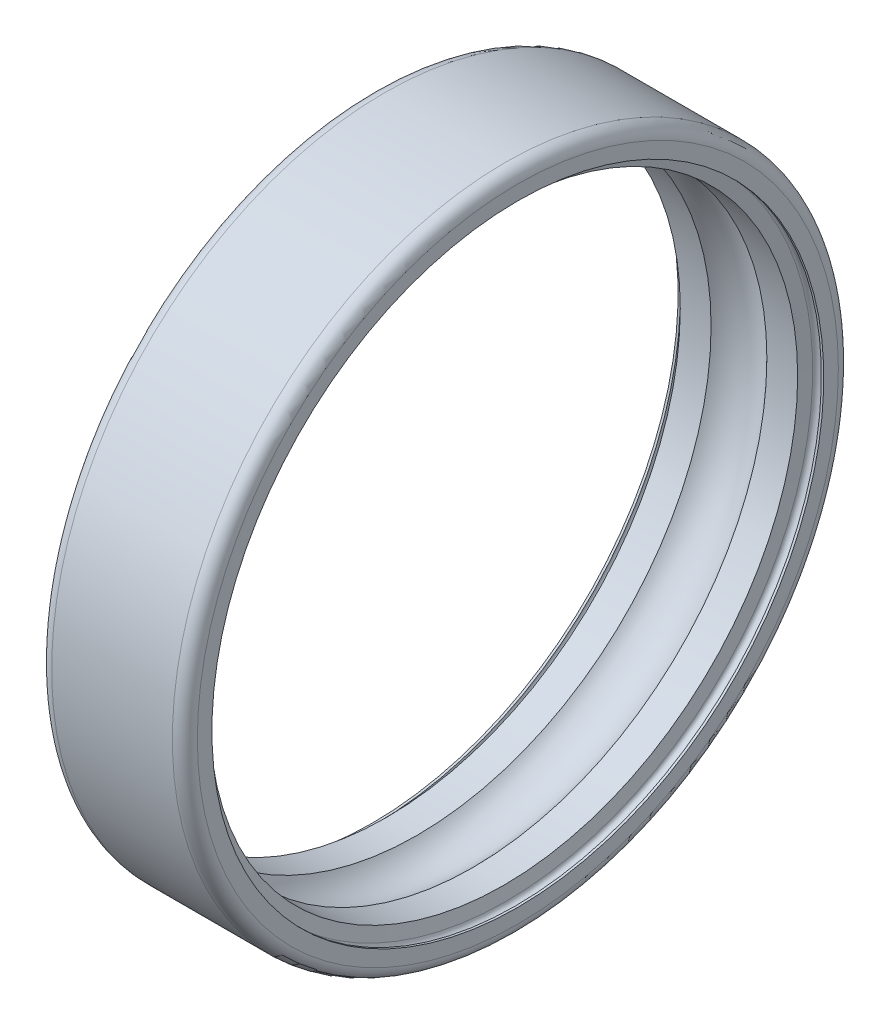
ISO-10303-21;
HEADER;
FILE_DESCRIPTION(('STEP AP214'),'2;1');
FILE_NAME('part.step','',(''),(''),'','','');
FILE_SCHEMA(('AUTOMOTIVE_DESIGN { 1 0 10303 214 1 1 1 1 }'));
ENDSEC;
DATA;
#1=APPLICATION_CONTEXT('core data for automotive mechanical design processes');
#2=APPLICATION_PROTOCOL_DEFINITION('international standard','automotive_design',2000,#1);
#3=PRODUCT_CONTEXT('',#1,'mechanical');
#4=PRODUCT('Part','Part','',(#3));
#5=PRODUCT_RELATED_PRODUCT_CATEGORY('part','',(#4));
#6=PRODUCT_DEFINITION_FORMATION('','',#4);
#7=PRODUCT_DEFINITION_CONTEXT('part definition',#1,'design');
#8=PRODUCT_DEFINITION('design','',#6,#7);
#9=PRODUCT_DEFINITION_SHAPE('','',#8);
#10=(LENGTH_UNIT() NAMED_UNIT(*) SI_UNIT(.MILLI.,.METRE.));
#11=(NAMED_UNIT(*) PLANE_ANGLE_UNIT() SI_UNIT($,.RADIAN.));
#12=(NAMED_UNIT(*) SI_UNIT($,.STERADIAN.) SOLID_ANGLE_UNIT());
#13=UNCERTAINTY_MEASURE_WITH_UNIT(LENGTH_MEASURE(1.E-05),#10,'distance_accuracy_value','');
#14=(GEOMETRIC_REPRESENTATION_CONTEXT(3) GLOBAL_UNCERTAINTY_ASSIGNED_CONTEXT((#13)) GLOBAL_UNIT_ASSIGNED_CONTEXT((#10,
#11,#12)) REPRESENTATION_CONTEXT('',''));
#15=CARTESIAN_POINT('',(0.,0.,0.));
#16=DIRECTION('',(0.,0.,1.));
#17=DIRECTION('',(1.,0.,0.));
#18=AXIS2_PLACEMENT_3D('',#15,#16,#17);
#19=CARTESIAN_POINT('',(6.655,0.,0.));
#20=DIRECTION('',(1.,0.,0.));
#21=DIRECTION('',(0.,0.,-1.));
#22=AXIS2_PLACEMENT_3D('',#19,#20,#21);
#23=TOROIDAL_SURFACE('',#22,14.7,0.23);
#24=CARTESIAN_POINT('',(6.885,0.,0.));
#25=DIRECTION('',(1.,0.,0.));
#26=DIRECTION('',(0.,1.,0.));
#27=AXIS2_PLACEMENT_3D('',#24,#25,#26);
#28=CIRCLE('',#27,14.7);
#29=CARTESIAN_POINT('',(6.885,14.7,0.));
#30=VERTEX_POINT('',#29);
#31=EDGE_CURVE('E10',#30,#30,#28,.T.);
#32=ORIENTED_EDGE('',*,*,#31,.T.);
#33=EDGE_LOOP('',(#32));
#34=FACE_BOUND('',#33,.T.);
#35=CARTESIAN_POINT('',(6.42849421680719,0.,0.));
#36=DIRECTION('',(1.,0.,0.));
#37=DIRECTION('',(0.,1.,0.));
#38=AXIS2_PLACEMENT_3D('',#35,#36,#37);
#39=CIRCLE('',#38,14.7399390808634);
#40=CARTESIAN_POINT('',(6.42849421680719,14.7399390808634,0.));
#41=VERTEX_POINT('',#40);
#42=EDGE_CURVE('E82',#41,#41,#39,.T.);
#43=ORIENTED_EDGE('',*,*,#42,.F.);
#44=EDGE_LOOP('',(#43));
#45=FACE_BOUND('',#44,.T.);
#46=ADVANCED_FACE('F15',(#34,#45),#23,.F.);
#47=CARTESIAN_POINT('',(6.9425,0.,0.));
#48=DIRECTION('',(-1.,0.,0.));
#49=DIRECTION('',(0.,1.,0.));
#50=AXIS2_PLACEMENT_3D('',#47,#48,#49);
#51=CYLINDRICAL_SURFACE('',#50,14.7);
#52=CARTESIAN_POINT('',(7.,0.,0.));
#53=DIRECTION('',(1.,0.,0.));
#54=DIRECTION('',(0.,1.,0.));
#55=AXIS2_PLACEMENT_3D('',#52,#53,#54);
#56=CIRCLE('',#55,14.7);
#57=CARTESIAN_POINT('',(7.,14.7,0.));
#58=VERTEX_POINT('',#57);
#59=EDGE_CURVE('E25',#58,#58,#56,.T.);
#60=ORIENTED_EDGE('',*,*,#59,.T.);
#61=EDGE_LOOP('',(#60));
#62=FACE_BOUND('',#61,.T.);
#63=ORIENTED_EDGE('',*,*,#31,.F.);
#64=EDGE_LOOP('',(#63));
#65=FACE_BOUND('',#64,.T.);
#66=ADVANCED_FACE('F117',(#62,#65),#51,.F.);
#67=CARTESIAN_POINT('',(7.,15.05,0.));
#68=DIRECTION('',(1.,0.,0.));
#69=DIRECTION('',(0.,1.,0.));
#70=AXIS2_PLACEMENT_3D('',#67,#68,#69);
#71=PLANE('',#70);
#72=CARTESIAN_POINT('',(7.,0.,0.));
#73=DIRECTION('',(1.,0.,0.));
#74=DIRECTION('',(0.,1.,0.));
#75=AXIS2_PLACEMENT_3D('',#72,#73,#74);
#76=CIRCLE('',#75,15.4);
#77=CARTESIAN_POINT('',(7.,15.4,0.));
#78=VERTEX_POINT('',#77);
#79=EDGE_CURVE('E90',#78,#78,#76,.T.);
#80=ORIENTED_EDGE('',*,*,#79,.T.);
#81=EDGE_LOOP('',(#80));
#82=FACE_BOUND('',#81,.T.);
#83=ORIENTED_EDGE('',*,*,#59,.F.);
#84=EDGE_LOOP('',(#83));
#85=FACE_BOUND('',#84,.T.);
#86=ADVANCED_FACE('F113',(#82,#85),#71,.T.);
#87=CARTESIAN_POINT('',(6.4,0.,0.));
#88=DIRECTION('',(1.,0.,0.));
#89=DIRECTION('',(0.,0.,-1.));
#90=AXIS2_PLACEMENT_3D('',#87,#88,#89);
#91=TOROIDAL_SURFACE('',#90,15.4,0.6);
#92=CARTESIAN_POINT('',(6.4,0.,0.));
#93=DIRECTION('',(1.,0.,0.));
#94=DIRECTION('',(0.,1.,0.));
#95=AXIS2_PLACEMENT_3D('',#92,#93,#94);
#96=CIRCLE('',#95,16.);
#97=CARTESIAN_POINT('',(6.4,16.,0.));
#98=VERTEX_POINT('',#97);
#99=EDGE_CURVE('E92',#98,#98,#96,.T.);
#100=ORIENTED_EDGE('',*,*,#99,.T.);
#101=EDGE_LOOP('',(#100));
#102=FACE_BOUND('',#101,.T.);
#103=ORIENTED_EDGE('',*,*,#79,.F.);
#104=EDGE_LOOP('',(#103));
#105=FACE_BOUND('',#104,.T.);
#106=ADVANCED_FACE('F17',(#102,#105),#91,.T.);
#107=CARTESIAN_POINT('',(3.5,0.,0.));
#108=DIRECTION('',(-1.,0.,0.));
#109=DIRECTION('',(0.,1.,0.));
#110=AXIS2_PLACEMENT_3D('',#107,#108,#109);
#111=CYLINDRICAL_SURFACE('',#110,16.);
#112=CARTESIAN_POINT('',(0.6,0.,0.));
#113=DIRECTION('',(1.,0.,0.));
#114=DIRECTION('',(0.,1.,0.));
#115=AXIS2_PLACEMENT_3D('',#112,#113,#114);
#116=CIRCLE('',#115,16.);
#117=CARTESIAN_POINT('',(0.6,16.,0.));
#118=VERTEX_POINT('',#117);
#119=EDGE_CURVE('E94',#118,#118,#116,.T.);
#120=ORIENTED_EDGE('',*,*,#119,.T.);
#121=EDGE_LOOP('',(#120));
#122=FACE_BOUND('',#121,.T.);
#123=ORIENTED_EDGE('',*,*,#99,.F.);
#124=EDGE_LOOP('',(#123));
#125=FACE_BOUND('',#124,.T.);
#126=ADVANCED_FACE('F101',(#122,#125),#111,.T.);
#127=CARTESIAN_POINT('',(0.6,0.,0.));
#128=DIRECTION('',(1.,0.,0.));
#129=DIRECTION('',(0.,0.,-1.));
#130=AXIS2_PLACEMENT_3D('',#127,#128,#129);
#131=TOROIDAL_SURFACE('',#130,15.4,0.6);
#132=CARTESIAN_POINT('',(0.,0.,0.));
#133=DIRECTION('',(1.,0.,0.));
#134=DIRECTION('',(0.,1.,0.));
#135=AXIS2_PLACEMENT_3D('',#132,#133,#134);
#136=CIRCLE('',#135,15.4);
#137=CARTESIAN_POINT('',(0.,15.4,0.));
#138=VERTEX_POINT('',#137);
#139=EDGE_CURVE('E73',#138,#138,#136,.T.);
#140=ORIENTED_EDGE('',*,*,#139,.T.);
#141=EDGE_LOOP('',(#140));
#142=FACE_BOUND('',#141,.T.);
#143=ORIENTED_EDGE('',*,*,#119,.F.);
#144=EDGE_LOOP('',(#143));
#145=FACE_BOUND('',#144,.T.);
#146=ADVANCED_FACE('F103',(#142,#145),#131,.T.);
#147=CARTESIAN_POINT('',(0.,15.05,0.));
#148=DIRECTION('',(-1.,0.,0.));
#149=DIRECTION('',(0.,-1.,0.));
#150=AXIS2_PLACEMENT_3D('',#147,#148,#149);
#151=PLANE('',#150);
#152=CARTESIAN_POINT('',(0.,0.,0.));
#153=DIRECTION('',(1.,0.,0.));
#154=DIRECTION('',(0.,1.,0.));
#155=AXIS2_PLACEMENT_3D('',#152,#153,#154);
#156=CIRCLE('',#155,14.7);
#157=CARTESIAN_POINT('',(0.,14.7,0.));
#158=VERTEX_POINT('',#157);
#159=EDGE_CURVE('E19',#158,#158,#156,.T.);
#160=ORIENTED_EDGE('',*,*,#159,.T.);
#161=EDGE_LOOP('',(#160));
#162=FACE_BOUND('',#161,.T.);
#163=ORIENTED_EDGE('',*,*,#139,.F.);
#164=EDGE_LOOP('',(#163));
#165=FACE_BOUND('',#164,.T.);
#166=ADVANCED_FACE('F111',(#162,#165),#151,.T.);
#167=CARTESIAN_POINT('',(0.0575,0.,0.));
#168=DIRECTION('',(-1.,0.,0.));
#169=DIRECTION('',(0.,1.,0.));
#170=AXIS2_PLACEMENT_3D('',#167,#168,#169);
#171=CYLINDRICAL_SURFACE('',#170,14.7);
#172=CARTESIAN_POINT('',(0.115,0.,0.));
#173=DIRECTION('',(1.,0.,0.));
#174=DIRECTION('',(0.,1.,0.));
#175=AXIS2_PLACEMENT_3D('',#172,#173,#174);
#176=CIRCLE('',#175,14.7);
#177=CARTESIAN_POINT('',(0.115,14.7,0.));
#178=VERTEX_POINT('',#177);
#179=EDGE_CURVE('E67',#178,#178,#176,.T.);
#180=ORIENTED_EDGE('',*,*,#179,.T.);
#181=EDGE_LOOP('',(#180));
#182=FACE_BOUND('',#181,.T.);
#183=ORIENTED_EDGE('',*,*,#159,.F.);
#184=EDGE_LOOP('',(#183));
#185=FACE_BOUND('',#184,.T.);
#186=ADVANCED_FACE('F68',(#182,#185),#171,.F.);
#187=CARTESIAN_POINT('',(0.345,0.,0.));
#188=DIRECTION('',(1.,0.,0.));
#189=DIRECTION('',(0.,0.,-1.));
#190=AXIS2_PLACEMENT_3D('',#187,#188,#189);
#191=TOROIDAL_SURFACE('',#190,14.7,0.23);
#192=CARTESIAN_POINT('',(0.571505783192808,0.,0.));
#193=DIRECTION('',(1.,0.,0.));
#194=DIRECTION('',(0.,1.,0.));
#195=AXIS2_PLACEMENT_3D('',#192,#193,#194);
#196=CIRCLE('',#195,14.7399390808634);
#197=CARTESIAN_POINT('',(0.571505783192807,14.7399390808634,0.));
#198=VERTEX_POINT('',#197);
#199=EDGE_CURVE('E71',#198,#198,#196,.T.);
#200=ORIENTED_EDGE('',*,*,#199,.T.);
#201=EDGE_LOOP('',(#200));
#202=FACE_BOUND('',#201,.T.);
#203=ORIENTED_EDGE('',*,*,#179,.F.);
#204=EDGE_LOOP('',(#203));
#205=FACE_BOUND('',#204,.T.);
#206=ADVANCED_FACE('F129',(#202,#205),#191,.F.);
#207=CARTESIAN_POINT('',(0.625720958916948,0.,0.));
#208=DIRECTION('',(-1.,0.,0.));
#209=DIRECTION('',(0.,1.,0.));
#210=AXIS2_PLACEMENT_3D('',#207,#208,#209);
#211=CONICAL_SURFACE('',#210,14.4324695404317,1.39626340159546);
#212=CARTESIAN_POINT('',(0.679936134641088,0.,0.));
#213=DIRECTION('',(1.,0.,0.));
#214=DIRECTION('',(0.,1.,0.));
#215=AXIS2_PLACEMENT_3D('',#212,#213,#214);
#216=CIRCLE('',#215,14.125);
#217=CARTESIAN_POINT('',(0.679936134641088,14.125,0.));
#218=VERTEX_POINT('',#217);
#219=EDGE_CURVE('E74',#218,#218,#216,.T.);
#220=ORIENTED_EDGE('',*,*,#219,.T.);
#221=EDGE_LOOP('',(#220));
#222=FACE_BOUND('',#221,.T.);
#223=ORIENTED_EDGE('',*,*,#199,.F.);
#224=EDGE_LOOP('',(#223));
#225=FACE_BOUND('',#224,.T.);
#226=ADVANCED_FACE('F142',(#222,#225),#211,.F.);
#227=CARTESIAN_POINT('',(1.41973023639782,0.,0.));
#228=DIRECTION('',(-1.,0.,0.));
#229=DIRECTION('',(0.,1.,0.));
#230=AXIS2_PLACEMENT_3D('',#227,#228,#229);
#231=CYLINDRICAL_SURFACE('',#230,14.125);
#232=CARTESIAN_POINT('',(2.15952433815455,0.,0.));
#233=DIRECTION('',(1.,0.,0.));
#234=DIRECTION('',(0.,1.,0.));
#235=AXIS2_PLACEMENT_3D('',#232,#233,#234);
#236=CIRCLE('',#235,14.125);
#237=CARTESIAN_POINT('',(2.15952433815455,14.125,0.));
#238=VERTEX_POINT('',#237);
#239=EDGE_CURVE('E78',#238,#238,#236,.T.);
#240=ORIENTED_EDGE('',*,*,#239,.T.);
#241=EDGE_LOOP('',(#240));
#242=FACE_BOUND('',#241,.T.);
#243=ORIENTED_EDGE('',*,*,#219,.F.);
#244=EDGE_LOOP('',(#243));
#245=FACE_BOUND('',#244,.T.);
#246=ADVANCED_FACE('F139',(#242,#245),#231,.F.);
#247=CARTESIAN_POINT('',(3.5,0.,0.));
#248=DIRECTION('',(1.,0.,0.));
#249=DIRECTION('',(0.,0.,-1.));
#250=AXIS2_PLACEMENT_3D('',#247,#248,#249);
#251=TOROIDAL_SURFACE('',#250,13.,1.75);
#252=CARTESIAN_POINT('',(4.84047566184545,0.,0.));
#253=DIRECTION('',(1.,0.,0.));
#254=DIRECTION('',(0.,1.,0.));
#255=AXIS2_PLACEMENT_3D('',#252,#253,#254);
#256=CIRCLE('',#255,14.125);
#257=CARTESIAN_POINT('',(4.84047566184545,14.125,0.));
#258=VERTEX_POINT('',#257);
#259=EDGE_CURVE('E79',#258,#258,#256,.T.);
#260=ORIENTED_EDGE('',*,*,#259,.T.);
#261=EDGE_LOOP('',(#260));
#262=FACE_BOUND('',#261,.T.);
#263=ORIENTED_EDGE('',*,*,#239,.F.);
#264=EDGE_LOOP('',(#263));
#265=FACE_BOUND('',#264,.T.);
#266=ADVANCED_FACE('F134',(#262,#265),#251,.F.);
#267=CARTESIAN_POINT('',(5.58026976360218,0.,0.));
#268=DIRECTION('',(-1.,0.,0.));
#269=DIRECTION('',(0.,1.,0.));
#270=AXIS2_PLACEMENT_3D('',#267,#268,#269);
#271=CYLINDRICAL_SURFACE('',#270,14.125);
#272=CARTESIAN_POINT('',(6.32006386535891,0.,0.));
#273=DIRECTION('',(1.,0.,0.));
#274=DIRECTION('',(0.,1.,0.));
#275=AXIS2_PLACEMENT_3D('',#272,#273,#274);
#276=CIRCLE('',#275,14.125);
#277=CARTESIAN_POINT('',(6.32006386535891,14.125,0.));
#278=VERTEX_POINT('',#277);
#279=EDGE_CURVE('E86',#278,#278,#276,.T.);
#280=ORIENTED_EDGE('',*,*,#279,.T.);
#281=EDGE_LOOP('',(#280));
#282=FACE_BOUND('',#281,.T.);
#283=ORIENTED_EDGE('',*,*,#259,.F.);
#284=EDGE_LOOP('',(#283));
#285=FACE_BOUND('',#284,.T.);
#286=ADVANCED_FACE('F130',(#282,#285),#271,.F.);
#287=CARTESIAN_POINT('',(6.37427904108305,0.,0.));
#288=DIRECTION('',(1.,0.,0.));
#289=DIRECTION('',(0.,1.,0.));
#290=AXIS2_PLACEMENT_3D('',#287,#288,#289);
#291=CONICAL_SURFACE('',#290,14.4324695404317,1.39626340159546);
#292=ORIENTED_EDGE('',*,*,#42,.T.);
#293=EDGE_LOOP('',(#292));
#294=FACE_BOUND('',#293,.T.);
#295=ORIENTED_EDGE('',*,*,#279,.F.);
#296=EDGE_LOOP('',(#295));
#297=FACE_BOUND('',#296,.T.);
#298=ADVANCED_FACE('F133',(#294,#297),#291,.F.);
#299=CLOSED_SHELL('',(#46,#66,#86,#106,#126,#146,#166,#186,#206,#226,#246,#266,#286,#298));
#300=MANIFOLD_SOLID_BREP('B1',#299);
#301=ADVANCED_BREP_SHAPE_REPRESENTATION('',(#18,#300),#14);
#302=SHAPE_DEFINITION_REPRESENTATION(#9,#301);
ENDSEC;
END-ISO-10303-21;
